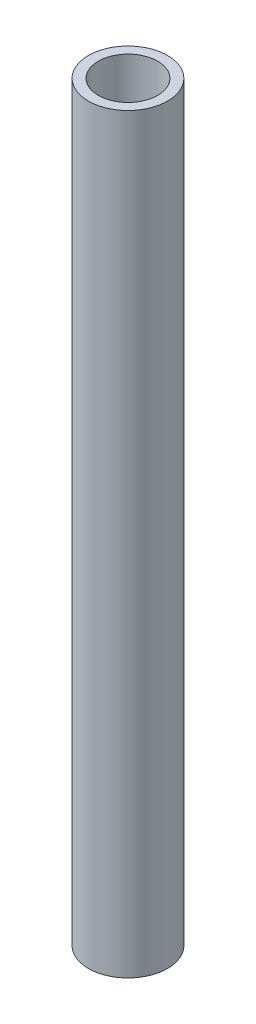
ISO-10303-21;
HEADER;
FILE_DESCRIPTION(('STEP AP214'),'2;1');
FILE_NAME('part.step','',(''),(''),'','','');
FILE_SCHEMA(('AUTOMOTIVE_DESIGN { 1 0 10303 214 1 1 1 1 }'));
ENDSEC;
DATA;
#1=APPLICATION_CONTEXT('core data for automotive mechanical design processes');
#2=APPLICATION_PROTOCOL_DEFINITION('international standard','automotive_design',2000,#1);
#3=PRODUCT_CONTEXT('',#1,'mechanical');
#4=PRODUCT('Part','Part','',(#3));
#5=PRODUCT_RELATED_PRODUCT_CATEGORY('part','',(#4));
#6=PRODUCT_DEFINITION_FORMATION('','',#4);
#7=PRODUCT_DEFINITION_CONTEXT('part definition',#1,'design');
#8=PRODUCT_DEFINITION('design','',#6,#7);
#9=PRODUCT_DEFINITION_SHAPE('','',#8);
#10=(LENGTH_UNIT() NAMED_UNIT(*) SI_UNIT(.MILLI.,.METRE.));
#11=(NAMED_UNIT(*) PLANE_ANGLE_UNIT() SI_UNIT($,.RADIAN.));
#12=(NAMED_UNIT(*) SI_UNIT($,.STERADIAN.) SOLID_ANGLE_UNIT());
#13=UNCERTAINTY_MEASURE_WITH_UNIT(LENGTH_MEASURE(1.E-05),#10,'distance_accuracy_value','');
#14=(GEOMETRIC_REPRESENTATION_CONTEXT(3) GLOBAL_UNCERTAINTY_ASSIGNED_CONTEXT((#13)) GLOBAL_UNIT_ASSIGNED_CONTEXT((#10,
#11,#12)) REPRESENTATION_CONTEXT('',''));
#15=CARTESIAN_POINT('',(0.,0.,0.));
#16=DIRECTION('',(0.,0.,1.));
#17=DIRECTION('',(1.,0.,0.));
#18=AXIS2_PLACEMENT_3D('',#15,#16,#17);
#19=CARTESIAN_POINT('',(-391.18166808322,241.3,-212.743279788072));
#20=DIRECTION('',(0.,1.,0.));
#21=DIRECTION('',(0.,0.,1.));
#22=AXIS2_PLACEMENT_3D('',#19,#20,#21);
#23=PLANE('',#22);
#24=CARTESIAN_POINT('',(-391.18166808322,241.3,-212.743279788072));
#25=DIRECTION('',(0.,1.,0.));
#26=DIRECTION('',(0.,0.,1.));
#27=AXIS2_PLACEMENT_3D('',#24,#25,#26);
#28=CIRCLE('',#27,12.7);
#29=CARTESIAN_POINT('',(-391.18166808322,241.3,-200.043279788072));
#30=VERTEX_POINT('',#29);
#31=EDGE_CURVE('E10',#30,#30,#28,.T.);
#32=ORIENTED_EDGE('',*,*,#31,.T.);
#33=EDGE_LOOP('',(#32));
#34=FACE_BOUND('',#33,.T.);
#35=CARTESIAN_POINT('',(-391.18166808322,241.3,-212.743279788072));
#36=DIRECTION('',(0.,1.,0.));
#37=DIRECTION('',(0.,0.,1.));
#38=AXIS2_PLACEMENT_3D('',#35,#36,#37);
#39=CIRCLE('',#38,9.52500000000002);
#40=CARTESIAN_POINT('',(-391.18166808322,241.3,-203.218279788071));
#41=VERTEX_POINT('',#40);
#42=EDGE_CURVE('E43',#41,#41,#39,.T.);
#43=ORIENTED_EDGE('',*,*,#42,.F.);
#44=EDGE_LOOP('',(#43));
#45=FACE_BOUND('',#44,.T.);
#46=ADVANCED_FACE('F32',(#34,#45),#23,.T.);
#47=CARTESIAN_POINT('',(-391.18166808322,0.,-212.743279788072));
#48=DIRECTION('',(0.,1.,0.));
#49=DIRECTION('',(0.,0.,1.));
#50=AXIS2_PLACEMENT_3D('',#47,#48,#49);
#51=PLANE('',#50);
#52=CARTESIAN_POINT('',(-391.18166808322,0.,-212.743279788072));
#53=DIRECTION('',(0.,1.,0.));
#54=DIRECTION('',(0.,0.,1.));
#55=AXIS2_PLACEMENT_3D('',#52,#53,#54);
#56=CIRCLE('',#55,12.7);
#57=CARTESIAN_POINT('',(-391.18166808322,0.,-200.043279788072));
#58=VERTEX_POINT('',#57);
#59=EDGE_CURVE('E36',#58,#58,#56,.T.);
#60=ORIENTED_EDGE('',*,*,#59,.F.);
#61=EDGE_LOOP('',(#60));
#62=FACE_BOUND('',#61,.T.);
#63=CARTESIAN_POINT('',(-391.18166808322,0.,-212.743279788072));
#64=DIRECTION('',(0.,1.,0.));
#65=DIRECTION('',(0.,0.,1.));
#66=AXIS2_PLACEMENT_3D('',#63,#64,#65);
#67=CIRCLE('',#66,9.52500000000002);
#68=CARTESIAN_POINT('',(-391.18166808322,0.,-203.218279788071));
#69=VERTEX_POINT('',#68);
#70=EDGE_CURVE('E45',#69,#69,#67,.T.);
#71=ORIENTED_EDGE('',*,*,#70,.T.);
#72=EDGE_LOOP('',(#71));
#73=FACE_BOUND('',#72,.T.);
#74=ADVANCED_FACE('F55',(#62,#73),#51,.F.);
#75=CARTESIAN_POINT('',(-391.18166808322,241.3,-212.743279788072));
#76=DIRECTION('',(0.,-1.,0.));
#77=DIRECTION('',(0.,0.,-1.));
#78=AXIS2_PLACEMENT_3D('',#75,#76,#77);
#79=CYLINDRICAL_SURFACE('',#78,12.7);
#80=ORIENTED_EDGE('',*,*,#31,.F.);
#81=EDGE_LOOP('',(#80));
#82=FACE_BOUND('',#81,.T.);
#83=ORIENTED_EDGE('',*,*,#59,.T.);
#84=EDGE_LOOP('',(#83));
#85=FACE_BOUND('',#84,.T.);
#86=ADVANCED_FACE('F34',(#82,#85),#79,.T.);
#87=CARTESIAN_POINT('',(-391.18166808322,241.3,-212.743279788072));
#88=DIRECTION('',(0.,-1.,0.));
#89=DIRECTION('',(0.,0.,-1.));
#90=AXIS2_PLACEMENT_3D('',#87,#88,#89);
#91=CYLINDRICAL_SURFACE('',#90,9.52500000000002);
#92=ORIENTED_EDGE('',*,*,#42,.T.);
#93=EDGE_LOOP('',(#92));
#94=FACE_BOUND('',#93,.T.);
#95=ORIENTED_EDGE('',*,*,#70,.F.);
#96=EDGE_LOOP('',(#95));
#97=FACE_BOUND('',#96,.T.);
#98=ADVANCED_FACE('F51',(#94,#97),#91,.F.);
#99=CLOSED_SHELL('',(#46,#74,#86,#98));
#100=MANIFOLD_SOLID_BREP('B2',#99);
#101=ADVANCED_BREP_SHAPE_REPRESENTATION('',(#18,#100),#14);
#102=SHAPE_DEFINITION_REPRESENTATION(#9,#101);
ENDSEC;
END-ISO-10303-21;
